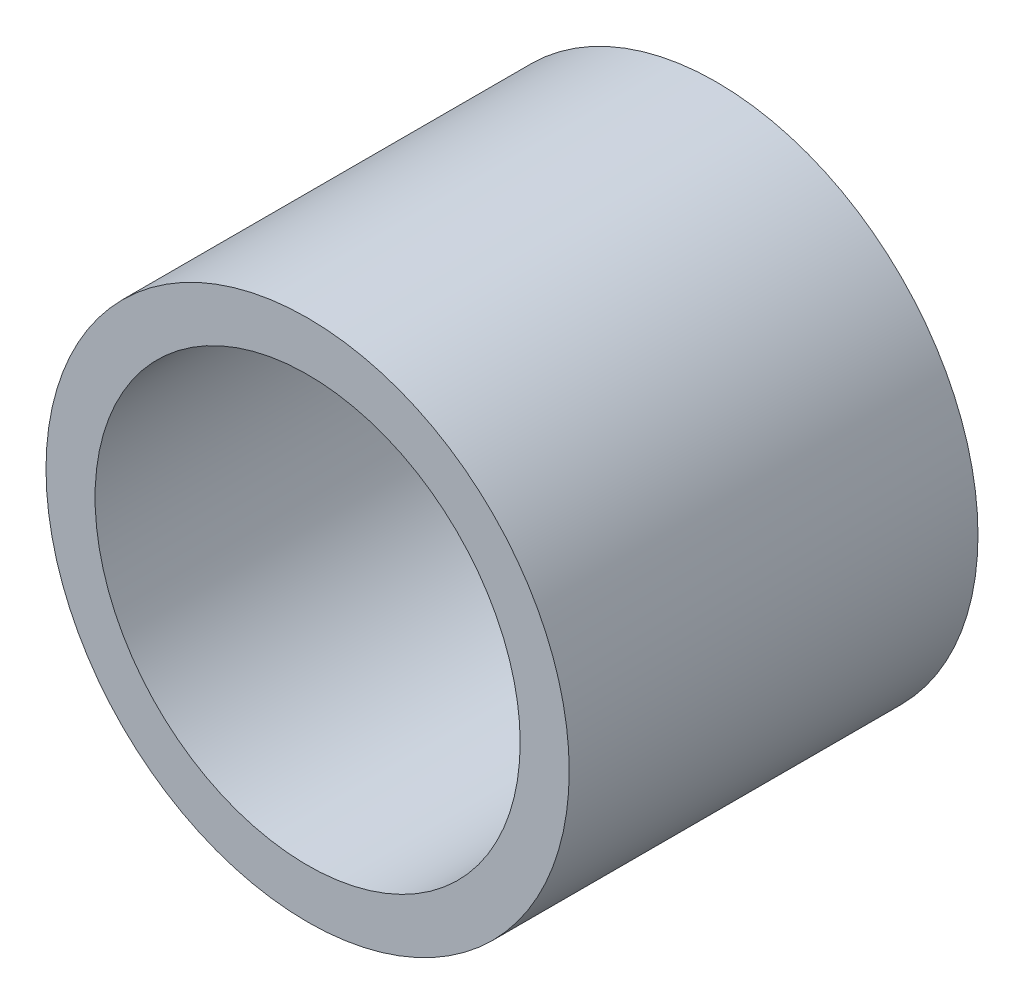
ISO-10303-21;
HEADER;
FILE_DESCRIPTION(('STEP AP214'),'2;1');
FILE_NAME('part.step','',(''),(''),'','','');
FILE_SCHEMA(('AUTOMOTIVE_DESIGN { 1 0 10303 214 1 1 1 1 }'));
ENDSEC;
DATA;
#1=APPLICATION_CONTEXT('core data for automotive mechanical design processes');
#2=APPLICATION_PROTOCOL_DEFINITION('international standard','automotive_design',2000,#1);
#3=PRODUCT_CONTEXT('',#1,'mechanical');
#4=PRODUCT('Part','Part','',(#3));
#5=PRODUCT_RELATED_PRODUCT_CATEGORY('part','',(#4));
#6=PRODUCT_DEFINITION_FORMATION('','',#4);
#7=PRODUCT_DEFINITION_CONTEXT('part definition',#1,'design');
#8=PRODUCT_DEFINITION('design','',#6,#7);
#9=PRODUCT_DEFINITION_SHAPE('','',#8);
#10=(LENGTH_UNIT() NAMED_UNIT(*) SI_UNIT(.MILLI.,.METRE.));
#11=(NAMED_UNIT(*) PLANE_ANGLE_UNIT() SI_UNIT($,.RADIAN.));
#12=(NAMED_UNIT(*) SI_UNIT($,.STERADIAN.) SOLID_ANGLE_UNIT());
#13=UNCERTAINTY_MEASURE_WITH_UNIT(LENGTH_MEASURE(1.E-05),#10,'distance_accuracy_value','');
#14=(GEOMETRIC_REPRESENTATION_CONTEXT(3) GLOBAL_UNCERTAINTY_ASSIGNED_CONTEXT((#13)) GLOBAL_UNIT_ASSIGNED_CONTEXT((#10,
#11,#12)) REPRESENTATION_CONTEXT('',''));
#15=CARTESIAN_POINT('',(0.,0.,0.));
#16=DIRECTION('',(0.,0.,1.));
#17=DIRECTION('',(1.,0.,0.));
#18=AXIS2_PLACEMENT_3D('',#15,#16,#17);
#19=CARTESIAN_POINT('',(0.,0.,25.));
#20=DIRECTION('',(0.,0.,1.));
#21=DIRECTION('',(1.,0.,0.));
#22=AXIS2_PLACEMENT_3D('',#19,#20,#21);
#23=PLANE('',#22);
#24=CARTESIAN_POINT('',(0.,0.,25.));
#25=DIRECTION('',(0.,0.,1.));
#26=DIRECTION('',(1.,0.,0.));
#27=AXIS2_PLACEMENT_3D('',#24,#25,#26);
#28=CIRCLE('',#27,16.);
#29=CARTESIAN_POINT('',(16.,0.,25.));
#30=VERTEX_POINT('',#29);
#31=EDGE_CURVE('E10',#30,#30,#28,.T.);
#32=ORIENTED_EDGE('',*,*,#31,.T.);
#33=EDGE_LOOP('',(#32));
#34=FACE_BOUND('',#33,.T.);
#35=CARTESIAN_POINT('',(0.,0.,25.));
#36=DIRECTION('',(0.,0.,1.));
#37=DIRECTION('',(1.,0.,0.));
#38=AXIS2_PLACEMENT_3D('',#35,#36,#37);
#39=CIRCLE('',#38,13.);
#40=CARTESIAN_POINT('',(13.,0.,25.));
#41=VERTEX_POINT('',#40);
#42=EDGE_CURVE('E43',#41,#41,#39,.T.);
#43=ORIENTED_EDGE('',*,*,#42,.F.);
#44=EDGE_LOOP('',(#43));
#45=FACE_BOUND('',#44,.T.);
#46=ADVANCED_FACE('F32',(#34,#45),#23,.T.);
#47=CARTESIAN_POINT('',(0.,0.,0.));
#48=DIRECTION('',(0.,0.,1.));
#49=DIRECTION('',(1.,0.,0.));
#50=AXIS2_PLACEMENT_3D('',#47,#48,#49);
#51=PLANE('',#50);
#52=CARTESIAN_POINT('',(0.,0.,0.));
#53=DIRECTION('',(0.,0.,1.));
#54=DIRECTION('',(1.,0.,0.));
#55=AXIS2_PLACEMENT_3D('',#52,#53,#54);
#56=CIRCLE('',#55,16.);
#57=CARTESIAN_POINT('',(16.,0.,0.));
#58=VERTEX_POINT('',#57);
#59=EDGE_CURVE('E36',#58,#58,#56,.T.);
#60=ORIENTED_EDGE('',*,*,#59,.F.);
#61=EDGE_LOOP('',(#60));
#62=FACE_BOUND('',#61,.T.);
#63=CARTESIAN_POINT('',(0.,0.,0.));
#64=DIRECTION('',(0.,0.,1.));
#65=DIRECTION('',(1.,0.,0.));
#66=AXIS2_PLACEMENT_3D('',#63,#64,#65);
#67=CIRCLE('',#66,13.);
#68=CARTESIAN_POINT('',(13.,0.,0.));
#69=VERTEX_POINT('',#68);
#70=EDGE_CURVE('E45',#69,#69,#67,.T.);
#71=ORIENTED_EDGE('',*,*,#70,.T.);
#72=EDGE_LOOP('',(#71));
#73=FACE_BOUND('',#72,.T.);
#74=ADVANCED_FACE('F55',(#62,#73),#51,.F.);
#75=CARTESIAN_POINT('',(0.,0.,25.));
#76=DIRECTION('',(0.,0.,-1.));
#77=DIRECTION('',(-1.,0.,0.));
#78=AXIS2_PLACEMENT_3D('',#75,#76,#77);
#79=CYLINDRICAL_SURFACE('',#78,16.);
#80=ORIENTED_EDGE('',*,*,#31,.F.);
#81=EDGE_LOOP('',(#80));
#82=FACE_BOUND('',#81,.T.);
#83=ORIENTED_EDGE('',*,*,#59,.T.);
#84=EDGE_LOOP('',(#83));
#85=FACE_BOUND('',#84,.T.);
#86=ADVANCED_FACE('F34',(#82,#85),#79,.T.);
#87=CARTESIAN_POINT('',(0.,0.,25.));
#88=DIRECTION('',(0.,0.,-1.));
#89=DIRECTION('',(-1.,0.,0.));
#90=AXIS2_PLACEMENT_3D('',#87,#88,#89);
#91=CYLINDRICAL_SURFACE('',#90,13.);
#92=ORIENTED_EDGE('',*,*,#42,.T.);
#93=EDGE_LOOP('',(#92));
#94=FACE_BOUND('',#93,.T.);
#95=ORIENTED_EDGE('',*,*,#70,.F.);
#96=EDGE_LOOP('',(#95));
#97=FACE_BOUND('',#96,.T.);
#98=ADVANCED_FACE('F51',(#94,#97),#91,.F.);
#99=CLOSED_SHELL('',(#46,#74,#86,#98));
#100=MANIFOLD_SOLID_BREP('B2',#99);
#101=ADVANCED_BREP_SHAPE_REPRESENTATION('',(#18,#100),#14);
#102=SHAPE_DEFINITION_REPRESENTATION(#9,#101);
ENDSEC;
END-ISO-10303-21;
